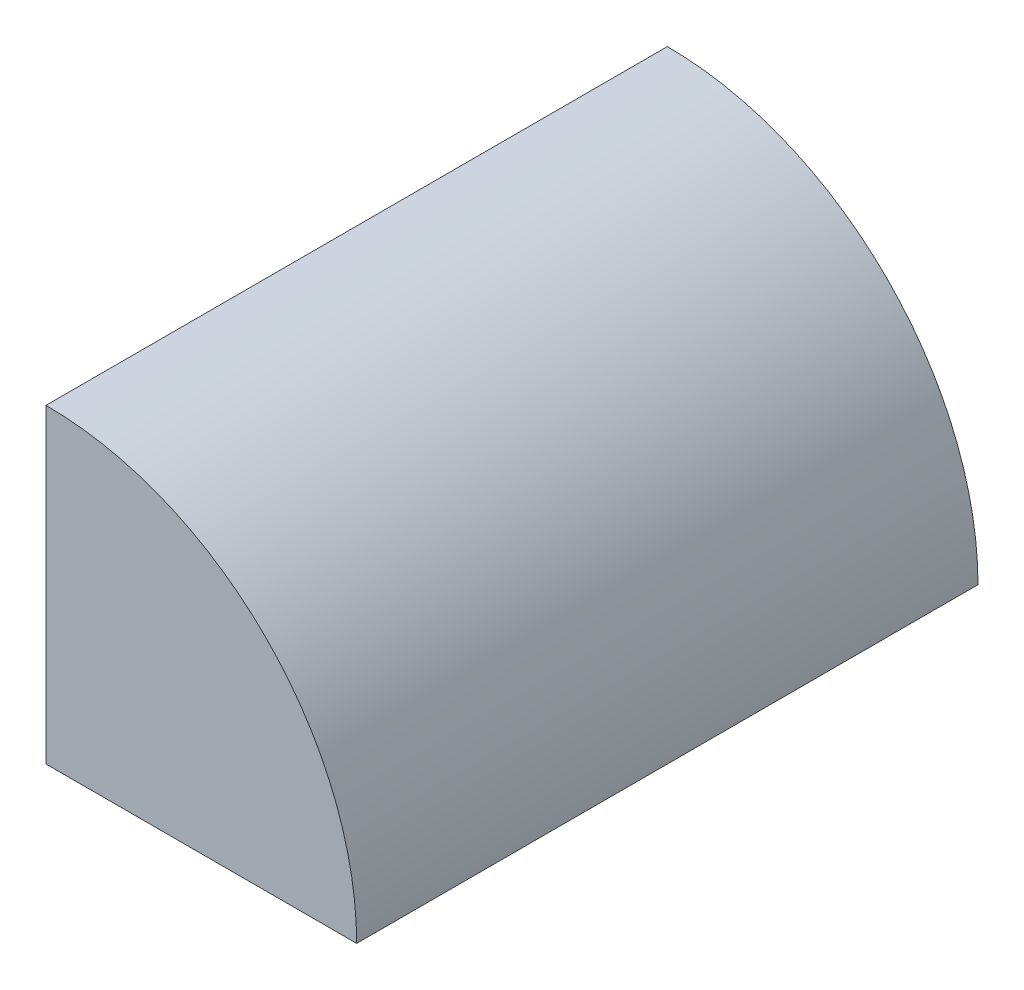
ISO-10303-21;
HEADER;
FILE_DESCRIPTION(('STEP AP214'),'2;1');
FILE_NAME('part.step','',(''),(''),'','','');
FILE_SCHEMA(('AUTOMOTIVE_DESIGN { 1 0 10303 214 1 1 1 1 }'));
ENDSEC;
DATA;
#1=APPLICATION_CONTEXT('core data for automotive mechanical design processes');
#2=APPLICATION_PROTOCOL_DEFINITION('international standard','automotive_design',2000,#1);
#3=PRODUCT_CONTEXT('',#1,'mechanical');
#4=PRODUCT('Part','Part','',(#3));
#5=PRODUCT_RELATED_PRODUCT_CATEGORY('part','',(#4));
#6=PRODUCT_DEFINITION_FORMATION('','',#4);
#7=PRODUCT_DEFINITION_CONTEXT('part definition',#1,'design');
#8=PRODUCT_DEFINITION('design','',#6,#7);
#9=PRODUCT_DEFINITION_SHAPE('','',#8);
#10=(LENGTH_UNIT() NAMED_UNIT(*) SI_UNIT(.MILLI.,.METRE.));
#11=(NAMED_UNIT(*) PLANE_ANGLE_UNIT() SI_UNIT($,.RADIAN.));
#12=(NAMED_UNIT(*) SI_UNIT($,.STERADIAN.) SOLID_ANGLE_UNIT());
#13=UNCERTAINTY_MEASURE_WITH_UNIT(LENGTH_MEASURE(1.E-05),#10,'distance_accuracy_value','');
#14=(GEOMETRIC_REPRESENTATION_CONTEXT(3) GLOBAL_UNCERTAINTY_ASSIGNED_CONTEXT((#13)) GLOBAL_UNIT_ASSIGNED_CONTEXT((#10,
#11,#12)) REPRESENTATION_CONTEXT('',''));
#15=CARTESIAN_POINT('',(0.,0.,0.));
#16=DIRECTION('',(0.,0.,1.));
#17=DIRECTION('',(1.,0.,0.));
#18=AXIS2_PLACEMENT_3D('',#15,#16,#17);
#19=CARTESIAN_POINT('',(0.,0.,12.7));
#20=DIRECTION('',(0.,0.,-1.));
#21=DIRECTION('',(-1.,0.,0.));
#22=AXIS2_PLACEMENT_3D('',#19,#20,#21);
#23=CYLINDRICAL_SURFACE('',#22,12.7);
#24=CARTESIAN_POINT('',(0.,0.,-12.7));
#25=DIRECTION('',(0.,0.,1.));
#26=DIRECTION('',(-1.,0.,0.));
#27=AXIS2_PLACEMENT_3D('',#24,#25,#26);
#28=CIRCLE('',#27,12.7);
#29=CARTESIAN_POINT('',(12.7,0.,-12.7));
#30=VERTEX_POINT('',#29);
#31=CARTESIAN_POINT('',(0.,12.7,-12.7));
#32=VERTEX_POINT('',#31);
#33=EDGE_CURVE('E69',#30,#32,#28,.T.);
#34=ORIENTED_EDGE('',*,*,#33,.T.);
#35=DIRECTION('',(0.,0.,-1.));
#36=VECTOR('',#35,1.);
#37=CARTESIAN_POINT('',(0.,12.7,12.7));
#38=LINE('',#37,#36);
#39=CARTESIAN_POINT('',(0.,12.7,12.7));
#40=VERTEX_POINT('',#39);
#41=EDGE_CURVE('E11',#40,#32,#38,.T.);
#42=ORIENTED_EDGE('',*,*,#41,.F.);
#43=CARTESIAN_POINT('',(0.,0.,12.7));
#44=DIRECTION('',(0.,0.,1.));
#45=DIRECTION('',(-1.,0.,0.));
#46=AXIS2_PLACEMENT_3D('',#43,#44,#45);
#47=CIRCLE('',#46,12.7);
#48=CARTESIAN_POINT('',(12.7,0.,12.7));
#49=VERTEX_POINT('',#48);
#50=EDGE_CURVE('E83',#49,#40,#47,.T.);
#51=ORIENTED_EDGE('',*,*,#50,.F.);
#52=DIRECTION('',(0.,0.,-1.));
#53=VECTOR('',#52,1.);
#54=CARTESIAN_POINT('',(12.7,0.,12.7));
#55=LINE('',#54,#53);
#56=EDGE_CURVE('E79',#49,#30,#55,.T.);
#57=ORIENTED_EDGE('',*,*,#56,.T.);
#58=EDGE_LOOP('',(#34,#42,#51,#57));
#59=FACE_BOUND('',#58,.T.);
#60=ADVANCED_FACE('F33',(#59),#23,.T.);
#61=CARTESIAN_POINT('',(0.,0.,12.7));
#62=DIRECTION('',(1.,0.,0.));
#63=DIRECTION('',(0.,0.,-1.));
#64=AXIS2_PLACEMENT_3D('',#61,#62,#63);
#65=PLANE('',#64);
#66=DIRECTION('',(0.,-1.,0.));
#67=VECTOR('',#66,1.);
#68=CARTESIAN_POINT('',(0.,0.,-12.7));
#69=LINE('',#68,#67);
#70=CARTESIAN_POINT('',(0.,0.,-12.7));
#71=VERTEX_POINT('',#70);
#72=EDGE_CURVE('E66',#32,#71,#69,.T.);
#73=ORIENTED_EDGE('',*,*,#72,.T.);
#74=DIRECTION('',(0.,0.,-1.));
#75=VECTOR('',#74,1.);
#76=CARTESIAN_POINT('',(0.,0.,12.7));
#77=LINE('',#76,#75);
#78=CARTESIAN_POINT('',(0.,0.,12.7));
#79=VERTEX_POINT('',#78);
#80=EDGE_CURVE('E40',#79,#71,#77,.T.);
#81=ORIENTED_EDGE('',*,*,#80,.F.);
#82=DIRECTION('',(0.,-1.,0.));
#83=VECTOR('',#82,1.);
#84=CARTESIAN_POINT('',(0.,0.,12.7));
#85=LINE('',#84,#83);
#86=EDGE_CURVE('E51',#40,#79,#85,.T.);
#87=ORIENTED_EDGE('',*,*,#86,.F.);
#88=ORIENTED_EDGE('',*,*,#41,.T.);
#89=EDGE_LOOP('',(#73,#81,#87,#88));
#90=FACE_BOUND('',#89,.T.);
#91=ADVANCED_FACE('F75',(#90),#65,.F.);
#92=CARTESIAN_POINT('',(12.7,0.,12.7));
#93=DIRECTION('',(0.,1.,0.));
#94=DIRECTION('',(-1.,0.,0.));
#95=AXIS2_PLACEMENT_3D('',#92,#93,#94);
#96=PLANE('',#95);
#97=DIRECTION('',(1.,0.,0.));
#98=VECTOR('',#97,1.);
#99=CARTESIAN_POINT('',(12.7,0.,-12.7));
#100=LINE('',#99,#98);
#101=EDGE_CURVE('E70',#71,#30,#100,.T.);
#102=ORIENTED_EDGE('',*,*,#101,.T.);
#103=ORIENTED_EDGE('',*,*,#56,.F.);
#104=DIRECTION('',(1.,0.,0.));
#105=VECTOR('',#104,1.);
#106=CARTESIAN_POINT('',(12.7,0.,12.7));
#107=LINE('',#106,#105);
#108=EDGE_CURVE('E47',#79,#49,#107,.T.);
#109=ORIENTED_EDGE('',*,*,#108,.F.);
#110=ORIENTED_EDGE('',*,*,#80,.T.);
#111=EDGE_LOOP('',(#102,#103,#109,#110));
#112=FACE_BOUND('',#111,.T.);
#113=ADVANCED_FACE('F88',(#112),#96,.F.);
#114=CARTESIAN_POINT('',(0.,0.,12.7));
#115=DIRECTION('',(0.,0.,-1.));
#116=DIRECTION('',(-1.,0.,0.));
#117=AXIS2_PLACEMENT_3D('',#114,#115,#116);
#118=PLANE('',#117);
#119=ORIENTED_EDGE('',*,*,#50,.T.);
#120=ORIENTED_EDGE('',*,*,#86,.T.);
#121=ORIENTED_EDGE('',*,*,#108,.T.);
#122=EDGE_LOOP('',(#119,#120,#121));
#123=FACE_BOUND('',#122,.T.);
#124=ADVANCED_FACE('F89',(#123),#118,.F.);
#125=CARTESIAN_POINT('',(0.,0.,-12.7));
#126=DIRECTION('',(0.,0.,-1.));
#127=DIRECTION('',(-1.,0.,0.));
#128=AXIS2_PLACEMENT_3D('',#125,#126,#127);
#129=PLANE('',#128);
#130=ORIENTED_EDGE('',*,*,#33,.F.);
#131=ORIENTED_EDGE('',*,*,#101,.F.);
#132=ORIENTED_EDGE('',*,*,#72,.F.);
#133=EDGE_LOOP('',(#130,#131,#132));
#134=FACE_BOUND('',#133,.T.);
#135=ADVANCED_FACE('F67',(#134),#129,.T.);
#136=CLOSED_SHELL('',(#60,#91,#113,#124,#135));
#137=MANIFOLD_SOLID_BREP('B2',#136);
#138=ADVANCED_BREP_SHAPE_REPRESENTATION('',(#18,#137),#14);
#139=SHAPE_DEFINITION_REPRESENTATION(#9,#138);
ENDSEC;
END-ISO-10303-21;
